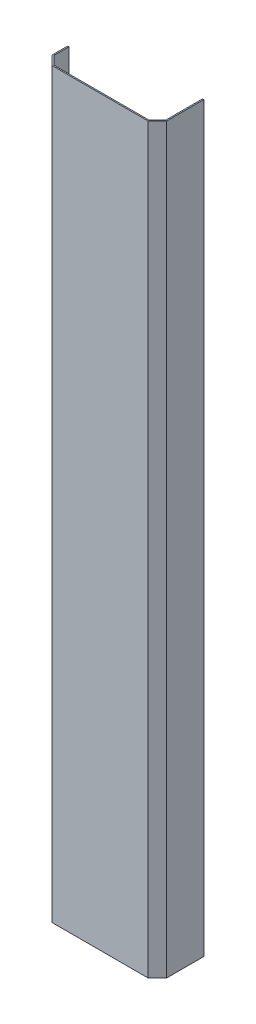
ISO-10303-21;
HEADER;
FILE_DESCRIPTION(('STEP AP214'),'2;1');
FILE_NAME('part.step','',(''),(''),'','','');
FILE_SCHEMA(('AUTOMOTIVE_DESIGN { 1 0 10303 214 1 1 1 1 }'));
ENDSEC;
DATA;
#1=APPLICATION_CONTEXT('core data for automotive mechanical design processes');
#2=APPLICATION_PROTOCOL_DEFINITION('international standard','automotive_design',2000,#1);
#3=PRODUCT_CONTEXT('',#1,'mechanical');
#4=PRODUCT('Part','Part','',(#3));
#5=PRODUCT_RELATED_PRODUCT_CATEGORY('part','',(#4));
#6=PRODUCT_DEFINITION_FORMATION('','',#4);
#7=PRODUCT_DEFINITION_CONTEXT('part definition',#1,'design');
#8=PRODUCT_DEFINITION('design','',#6,#7);
#9=PRODUCT_DEFINITION_SHAPE('','',#8);
#10=(LENGTH_UNIT() NAMED_UNIT(*) SI_UNIT(.MILLI.,.METRE.));
#11=(NAMED_UNIT(*) PLANE_ANGLE_UNIT() SI_UNIT($,.RADIAN.));
#12=(NAMED_UNIT(*) SI_UNIT($,.STERADIAN.) SOLID_ANGLE_UNIT());
#13=UNCERTAINTY_MEASURE_WITH_UNIT(LENGTH_MEASURE(1.E-05),#10,'distance_accuracy_value','');
#14=(GEOMETRIC_REPRESENTATION_CONTEXT(3) GLOBAL_UNCERTAINTY_ASSIGNED_CONTEXT((#13)) GLOBAL_UNIT_ASSIGNED_CONTEXT((#10,
#11,#12)) REPRESENTATION_CONTEXT('',''));
#15=CARTESIAN_POINT('',(0.,0.,0.));
#16=DIRECTION('',(0.,0.,1.));
#17=DIRECTION('',(1.,0.,0.));
#18=AXIS2_PLACEMENT_3D('',#15,#16,#17);
#19=CARTESIAN_POINT('',(83.5857864376268,1200.,83.5857864376269));
#20=DIRECTION('',(-0.707106781186547,0.,-0.707106781186548));
#21=DIRECTION('',(-0.707106781186548,0.,0.707106781186547));
#22=AXIS2_PLACEMENT_3D('',#19,#20,#21);
#23=PLANE('',#22);
#24=DIRECTION('',(0.707106781186548,0.,-0.707106781186547));
#25=VECTOR('',#24,1.);
#26=CARTESIAN_POINT('',(83.5857864376268,0.,83.5857864376269));
#27=LINE('',#26,#25);
#28=CARTESIAN_POINT('',(169.171572875254,0.,-2.));
#29=VERTEX_POINT('',#28);
#30=CARTESIAN_POINT('',(183.,0.,-15.8284271247462));
#31=VERTEX_POINT('',#30);
#32=EDGE_CURVE('E152',#29,#31,#27,.T.);
#33=ORIENTED_EDGE('',*,*,#32,.F.);
#34=DIRECTION('',(0.,-1.,0.));
#35=VECTOR('',#34,1.);
#36=CARTESIAN_POINT('',(169.171572875254,1200.,-2.));
#37=LINE('',#36,#35);
#38=CARTESIAN_POINT('',(169.171572875254,1200.,-2.));
#39=VERTEX_POINT('',#38);
#40=EDGE_CURVE('E11',#39,#29,#37,.T.);
#41=ORIENTED_EDGE('',*,*,#40,.F.);
#42=DIRECTION('',(0.707106781186548,0.,-0.707106781186547));
#43=VECTOR('',#42,1.);
#44=CARTESIAN_POINT('',(83.5857864376268,1200.,83.5857864376269));
#45=LINE('',#44,#43);
#46=CARTESIAN_POINT('',(183.,1200.,-15.8284271247462));
#47=VERTEX_POINT('',#46);
#48=EDGE_CURVE('E181',#39,#47,#45,.T.);
#49=ORIENTED_EDGE('',*,*,#48,.T.);
#50=DIRECTION('',(0.,-1.,0.));
#51=VECTOR('',#50,1.);
#52=CARTESIAN_POINT('',(183.,1200.,-15.8284271247462));
#53=LINE('',#52,#51);
#54=EDGE_CURVE('E51',#47,#31,#53,.T.);
#55=ORIENTED_EDGE('',*,*,#54,.T.);
#56=EDGE_LOOP('',(#33,#41,#49,#55));
#57=FACE_BOUND('',#56,.T.);
#58=ADVANCED_FACE('F35',(#57),#23,.T.);
#59=CARTESIAN_POINT('',(0.,1200.,-2.));
#60=DIRECTION('',(0.,0.,-1.));
#61=DIRECTION('',(-1.,0.,0.));
#62=AXIS2_PLACEMENT_3D('',#59,#60,#61);
#63=PLANE('',#62);
#64=DIRECTION('',(1.,0.,0.));
#65=VECTOR('',#64,1.);
#66=CARTESIAN_POINT('',(0.,0.,-2.));
#67=LINE('',#66,#65);
#68=CARTESIAN_POINT('',(15.8284271247462,0.,-2.));
#69=VERTEX_POINT('',#68);
#70=EDGE_CURVE('E154',#69,#29,#67,.T.);
#71=ORIENTED_EDGE('',*,*,#70,.F.);
#72=DIRECTION('',(0.,-1.,0.));
#73=VECTOR('',#72,1.);
#74=CARTESIAN_POINT('',(15.8284271247462,1200.,-2.));
#75=LINE('',#74,#73);
#76=CARTESIAN_POINT('',(15.8284271247462,1200.,-2.));
#77=VERTEX_POINT('',#76);
#78=EDGE_CURVE('E43',#77,#69,#75,.T.);
#79=ORIENTED_EDGE('',*,*,#78,.F.);
#80=DIRECTION('',(1.,0.,0.));
#81=VECTOR('',#80,1.);
#82=CARTESIAN_POINT('',(0.,1200.,-2.));
#83=LINE('',#82,#81);
#84=EDGE_CURVE('E212',#77,#39,#83,.T.);
#85=ORIENTED_EDGE('',*,*,#84,.T.);
#86=ORIENTED_EDGE('',*,*,#40,.T.);
#87=EDGE_LOOP('',(#71,#79,#85,#86));
#88=FACE_BOUND('',#87,.T.);
#89=ADVANCED_FACE('F211',(#88),#63,.T.);
#90=CARTESIAN_POINT('',(8.9142135623731,1200.,-8.9142135623731));
#91=DIRECTION('',(-0.707106781186548,0.,0.707106781186548));
#92=DIRECTION('',(0.707106781186548,0.,0.707106781186548));
#93=AXIS2_PLACEMENT_3D('',#90,#91,#92);
#94=PLANE('',#93);
#95=DIRECTION('',(-0.707106781186548,0.,-0.707106781186548));
#96=VECTOR('',#95,1.);
#97=CARTESIAN_POINT('',(8.9142135623731,0.,-8.9142135623731));
#98=LINE('',#97,#96);
#99=CARTESIAN_POINT('',(2.,0.,-15.8284271247462));
#100=VERTEX_POINT('',#99);
#101=EDGE_CURVE('E157',#69,#100,#98,.T.);
#102=ORIENTED_EDGE('',*,*,#101,.T.);
#103=DIRECTION('',(0.,-1.,0.));
#104=VECTOR('',#103,1.);
#105=CARTESIAN_POINT('',(2.,1200.,-15.8284271247462));
#106=LINE('',#105,#104);
#107=CARTESIAN_POINT('',(2.,1200.,-15.8284271247462));
#108=VERTEX_POINT('',#107);
#109=EDGE_CURVE('E196',#108,#100,#106,.T.);
#110=ORIENTED_EDGE('',*,*,#109,.F.);
#111=DIRECTION('',(-0.707106781186548,0.,-0.707106781186548));
#112=VECTOR('',#111,1.);
#113=CARTESIAN_POINT('',(8.9142135623731,1200.,-8.9142135623731));
#114=LINE('',#113,#112);
#115=EDGE_CURVE('E203',#77,#108,#114,.T.);
#116=ORIENTED_EDGE('',*,*,#115,.F.);
#117=ORIENTED_EDGE('',*,*,#78,.T.);
#118=EDGE_LOOP('',(#102,#110,#116,#117));
#119=FACE_BOUND('',#118,.T.);
#120=ADVANCED_FACE('F201',(#119),#94,.F.);
#121=CARTESIAN_POINT('',(2.,1200.,0.));
#122=DIRECTION('',(-1.,0.,0.));
#123=DIRECTION('',(0.,0.,1.));
#124=AXIS2_PLACEMENT_3D('',#121,#122,#123);
#125=PLANE('',#124);
#126=DIRECTION('',(0.,0.,-1.));
#127=VECTOR('',#126,1.);
#128=CARTESIAN_POINT('',(2.,0.,0.));
#129=LINE('',#128,#127);
#130=CARTESIAN_POINT('',(2.,0.,-40.));
#131=VERTEX_POINT('',#130);
#132=EDGE_CURVE('E159',#100,#131,#129,.T.);
#133=ORIENTED_EDGE('',*,*,#132,.T.);
#134=DIRECTION('',(0.,-1.,0.));
#135=VECTOR('',#134,1.);
#136=CARTESIAN_POINT('',(2.,1200.,-40.));
#137=LINE('',#136,#135);
#138=CARTESIAN_POINT('',(2.,1200.,-40.));
#139=VERTEX_POINT('',#138);
#140=EDGE_CURVE('E194',#139,#131,#137,.T.);
#141=ORIENTED_EDGE('',*,*,#140,.F.);
#142=DIRECTION('',(0.,0.,-1.));
#143=VECTOR('',#142,1.);
#144=CARTESIAN_POINT('',(2.,1200.,0.));
#145=LINE('',#144,#143);
#146=EDGE_CURVE('E353',#108,#139,#145,.T.);
#147=ORIENTED_EDGE('',*,*,#146,.F.);
#148=ORIENTED_EDGE('',*,*,#109,.T.);
#149=EDGE_LOOP('',(#133,#141,#147,#148));
#150=FACE_BOUND('',#149,.T.);
#151=ADVANCED_FACE('F230',(#150),#125,.F.);
#152=CARTESIAN_POINT('',(0.,1200.,-40.));
#153=DIRECTION('',(0.,0.,-1.));
#154=DIRECTION('',(-1.,0.,0.));
#155=AXIS2_PLACEMENT_3D('',#152,#153,#154);
#156=PLANE('',#155);
#157=DIRECTION('',(1.,0.,0.));
#158=VECTOR('',#157,1.);
#159=CARTESIAN_POINT('',(0.,0.,-40.));
#160=LINE('',#159,#158);
#161=CARTESIAN_POINT('',(0.,0.,-40.));
#162=VERTEX_POINT('',#161);
#163=EDGE_CURVE('E162',#162,#131,#160,.T.);
#164=ORIENTED_EDGE('',*,*,#163,.F.);
#165=DIRECTION('',(0.,-1.,0.));
#166=VECTOR('',#165,1.);
#167=CARTESIAN_POINT('',(0.,1200.,-40.));
#168=LINE('',#167,#166);
#169=CARTESIAN_POINT('',(0.,1200.,-40.));
#170=VERTEX_POINT('',#169);
#171=EDGE_CURVE('E192',#170,#162,#168,.T.);
#172=ORIENTED_EDGE('',*,*,#171,.F.);
#173=DIRECTION('',(1.,0.,0.));
#174=VECTOR('',#173,1.);
#175=CARTESIAN_POINT('',(0.,1200.,-40.));
#176=LINE('',#175,#174);
#177=EDGE_CURVE('E351',#170,#139,#176,.T.);
#178=ORIENTED_EDGE('',*,*,#177,.T.);
#179=ORIENTED_EDGE('',*,*,#140,.T.);
#180=EDGE_LOOP('',(#164,#172,#178,#179));
#181=FACE_BOUND('',#180,.T.);
#182=ADVANCED_FACE('F235',(#181),#156,.T.);
#183=CARTESIAN_POINT('',(0.,1200.,0.));
#184=DIRECTION('',(-1.,0.,0.));
#185=DIRECTION('',(0.,0.,1.));
#186=AXIS2_PLACEMENT_3D('',#183,#184,#185);
#187=PLANE('',#186);
#188=DIRECTION('',(0.,0.,-1.));
#189=VECTOR('',#188,1.);
#190=CARTESIAN_POINT('',(0.,0.,0.));
#191=LINE('',#190,#189);
#192=CARTESIAN_POINT('',(0.,0.,-15.));
#193=VERTEX_POINT('',#192);
#194=EDGE_CURVE('E165',#193,#162,#191,.T.);
#195=ORIENTED_EDGE('',*,*,#194,.F.);
#196=DIRECTION('',(0.,-1.,0.));
#197=VECTOR('',#196,1.);
#198=CARTESIAN_POINT('',(0.,1200.,-15.));
#199=LINE('',#198,#197);
#200=CARTESIAN_POINT('',(0.,1200.,-15.));
#201=VERTEX_POINT('',#200);
#202=EDGE_CURVE('E190',#201,#193,#199,.T.);
#203=ORIENTED_EDGE('',*,*,#202,.F.);
#204=DIRECTION('',(0.,0.,-1.));
#205=VECTOR('',#204,1.);
#206=CARTESIAN_POINT('',(0.,1200.,0.));
#207=LINE('',#206,#205);
#208=EDGE_CURVE('E355',#201,#170,#207,.T.);
#209=ORIENTED_EDGE('',*,*,#208,.T.);
#210=ORIENTED_EDGE('',*,*,#171,.T.);
#211=EDGE_LOOP('',(#195,#203,#209,#210));
#212=FACE_BOUND('',#211,.T.);
#213=ADVANCED_FACE('F239',(#212),#187,.T.);
#214=CARTESIAN_POINT('',(7.5,1200.,-7.5));
#215=DIRECTION('',(-0.707106781186548,0.,0.707106781186548));
#216=DIRECTION('',(0.707106781186548,0.,0.707106781186548));
#217=AXIS2_PLACEMENT_3D('',#214,#215,#216);
#218=PLANE('',#217);
#219=DIRECTION('',(-0.707106781186548,0.,-0.707106781186548));
#220=VECTOR('',#219,1.);
#221=CARTESIAN_POINT('',(7.5,0.,-7.5));
#222=LINE('',#221,#220);
#223=CARTESIAN_POINT('',(15.,0.,0.));
#224=VERTEX_POINT('',#223);
#225=EDGE_CURVE('E168',#224,#193,#222,.T.);
#226=ORIENTED_EDGE('',*,*,#225,.F.);
#227=DIRECTION('',(0.,-1.,0.));
#228=VECTOR('',#227,1.);
#229=CARTESIAN_POINT('',(15.,1200.,0.));
#230=LINE('',#229,#228);
#231=CARTESIAN_POINT('',(15.,1200.,0.));
#232=VERTEX_POINT('',#231);
#233=EDGE_CURVE('E188',#232,#224,#230,.T.);
#234=ORIENTED_EDGE('',*,*,#233,.F.);
#235=DIRECTION('',(-0.707106781186548,0.,-0.707106781186548));
#236=VECTOR('',#235,1.);
#237=CARTESIAN_POINT('',(7.5,1200.,-7.5));
#238=LINE('',#237,#236);
#239=EDGE_CURVE('E344',#232,#201,#238,.T.);
#240=ORIENTED_EDGE('',*,*,#239,.T.);
#241=ORIENTED_EDGE('',*,*,#202,.T.);
#242=EDGE_LOOP('',(#226,#234,#240,#241));
#243=FACE_BOUND('',#242,.T.);
#244=ADVANCED_FACE('F243',(#243),#218,.T.);
#245=CARTESIAN_POINT('',(0.,1200.,0.));
#246=DIRECTION('',(0.,0.,-1.));
#247=DIRECTION('',(-1.,0.,0.));
#248=AXIS2_PLACEMENT_3D('',#245,#246,#247);
#249=PLANE('',#248);
#250=DIRECTION('',(1.,0.,0.));
#251=VECTOR('',#250,1.);
#252=CARTESIAN_POINT('',(0.,0.,0.));
#253=LINE('',#252,#251);
#254=CARTESIAN_POINT('',(170.,0.,0.));
#255=VERTEX_POINT('',#254);
#256=EDGE_CURVE('E171',#224,#255,#253,.T.);
#257=ORIENTED_EDGE('',*,*,#256,.T.);
#258=DIRECTION('',(0.,-1.,0.));
#259=VECTOR('',#258,1.);
#260=CARTESIAN_POINT('',(170.,1200.,0.));
#261=LINE('',#260,#259);
#262=CARTESIAN_POINT('',(170.,1200.,0.));
#263=VERTEX_POINT('',#262);
#264=EDGE_CURVE('E185',#263,#255,#261,.T.);
#265=ORIENTED_EDGE('',*,*,#264,.F.);
#266=DIRECTION('',(1.,0.,0.));
#267=VECTOR('',#266,1.);
#268=CARTESIAN_POINT('',(0.,1200.,0.));
#269=LINE('',#268,#267);
#270=EDGE_CURVE('E362',#232,#263,#269,.T.);
#271=ORIENTED_EDGE('',*,*,#270,.F.);
#272=ORIENTED_EDGE('',*,*,#233,.T.);
#273=EDGE_LOOP('',(#257,#265,#271,#272));
#274=FACE_BOUND('',#273,.T.);
#275=ADVANCED_FACE('F247',(#274),#249,.F.);
#276=CARTESIAN_POINT('',(84.9999999999999,1200.,85.));
#277=DIRECTION('',(-0.707106781186547,0.,-0.707106781186548));
#278=DIRECTION('',(-0.707106781186548,0.,0.707106781186547));
#279=AXIS2_PLACEMENT_3D('',#276,#277,#278);
#280=PLANE('',#279);
#281=DIRECTION('',(0.707106781186548,0.,-0.707106781186547));
#282=VECTOR('',#281,1.);
#283=CARTESIAN_POINT('',(84.9999999999999,0.,85.));
#284=LINE('',#283,#282);
#285=CARTESIAN_POINT('',(185.,0.,-15.));
#286=VERTEX_POINT('',#285);
#287=EDGE_CURVE('E173',#255,#286,#284,.T.);
#288=ORIENTED_EDGE('',*,*,#287,.T.);
#289=DIRECTION('',(0.,-1.,0.));
#290=VECTOR('',#289,1.);
#291=CARTESIAN_POINT('',(185.,1200.,-15.));
#292=LINE('',#291,#290);
#293=CARTESIAN_POINT('',(185.,1200.,-15.));
#294=VERTEX_POINT('',#293);
#295=EDGE_CURVE('E144',#294,#286,#292,.T.);
#296=ORIENTED_EDGE('',*,*,#295,.F.);
#297=DIRECTION('',(0.707106781186548,0.,-0.707106781186547));
#298=VECTOR('',#297,1.);
#299=CARTESIAN_POINT('',(84.9999999999999,1200.,85.));
#300=LINE('',#299,#298);
#301=EDGE_CURVE('E132',#263,#294,#300,.T.);
#302=ORIENTED_EDGE('',*,*,#301,.F.);
#303=ORIENTED_EDGE('',*,*,#264,.T.);
#304=EDGE_LOOP('',(#288,#296,#302,#303));
#305=FACE_BOUND('',#304,.T.);
#306=ADVANCED_FACE('F251',(#305),#280,.F.);
#307=CARTESIAN_POINT('',(185.,1200.,0.));
#308=DIRECTION('',(-1.,0.,0.));
#309=DIRECTION('',(0.,0.,1.));
#310=AXIS2_PLACEMENT_3D('',#307,#308,#309);
#311=PLANE('',#310);
#312=DIRECTION('',(0.,0.,-1.));
#313=VECTOR('',#312,1.);
#314=CARTESIAN_POINT('',(185.,0.,0.));
#315=LINE('',#314,#313);
#316=CARTESIAN_POINT('',(185.,0.,-75.));
#317=VERTEX_POINT('',#316);
#318=EDGE_CURVE('E141',#286,#317,#315,.T.);
#319=ORIENTED_EDGE('',*,*,#318,.T.);
#320=DIRECTION('',(0.,-1.,0.));
#321=VECTOR('',#320,1.);
#322=CARTESIAN_POINT('',(185.,1200.,-75.));
#323=LINE('',#322,#321);
#324=CARTESIAN_POINT('',(185.,1200.,-75.));
#325=VERTEX_POINT('',#324);
#326=EDGE_CURVE('E138',#325,#317,#323,.T.);
#327=ORIENTED_EDGE('',*,*,#326,.F.);
#328=DIRECTION('',(0.,0.,-1.));
#329=VECTOR('',#328,1.);
#330=CARTESIAN_POINT('',(185.,1200.,0.));
#331=LINE('',#330,#329);
#332=EDGE_CURVE('E125',#294,#325,#331,.T.);
#333=ORIENTED_EDGE('',*,*,#332,.F.);
#334=ORIENTED_EDGE('',*,*,#295,.T.);
#335=EDGE_LOOP('',(#319,#327,#333,#334));
#336=FACE_BOUND('',#335,.T.);
#337=ADVANCED_FACE('F139',(#336),#311,.F.);
#338=CARTESIAN_POINT('',(0.,1200.,-75.));
#339=DIRECTION('',(0.,0.,1.));
#340=DIRECTION('',(1.,0.,0.));
#341=AXIS2_PLACEMENT_3D('',#338,#339,#340);
#342=PLANE('',#341);
#343=DIRECTION('',(-1.,0.,0.));
#344=VECTOR('',#343,1.);
#345=CARTESIAN_POINT('',(0.,0.,-75.));
#346=LINE('',#345,#344);
#347=CARTESIAN_POINT('',(183.,0.,-75.));
#348=VERTEX_POINT('',#347);
#349=EDGE_CURVE('E176',#317,#348,#346,.T.);
#350=ORIENTED_EDGE('',*,*,#349,.T.);
#351=DIRECTION('',(0.,-1.,0.));
#352=VECTOR('',#351,1.);
#353=CARTESIAN_POINT('',(183.,1200.,-75.));
#354=LINE('',#353,#352);
#355=CARTESIAN_POINT('',(183.,1200.,-75.));
#356=VERTEX_POINT('',#355);
#357=EDGE_CURVE('E89',#356,#348,#354,.T.);
#358=ORIENTED_EDGE('',*,*,#357,.F.);
#359=DIRECTION('',(-1.,0.,0.));
#360=VECTOR('',#359,1.);
#361=CARTESIAN_POINT('',(0.,1200.,-75.));
#362=LINE('',#361,#360);
#363=EDGE_CURVE('E130',#325,#356,#362,.T.);
#364=ORIENTED_EDGE('',*,*,#363,.F.);
#365=ORIENTED_EDGE('',*,*,#326,.T.);
#366=EDGE_LOOP('',(#350,#358,#364,#365));
#367=FACE_BOUND('',#366,.T.);
#368=ADVANCED_FACE('F146',(#367),#342,.F.);
#369=CARTESIAN_POINT('',(183.,1200.,0.));
#370=DIRECTION('',(-1.,0.,0.));
#371=DIRECTION('',(0.,0.,1.));
#372=AXIS2_PLACEMENT_3D('',#369,#370,#371);
#373=PLANE('',#372);
#374=DIRECTION('',(0.,0.,-1.));
#375=VECTOR('',#374,1.);
#376=CARTESIAN_POINT('',(183.,0.,0.));
#377=LINE('',#376,#375);
#378=EDGE_CURVE('E178',#31,#348,#377,.T.);
#379=ORIENTED_EDGE('',*,*,#378,.F.);
#380=ORIENTED_EDGE('',*,*,#54,.F.);
#381=DIRECTION('',(0.,0.,-1.));
#382=VECTOR('',#381,1.);
#383=CARTESIAN_POINT('',(183.,1200.,0.));
#384=LINE('',#383,#382);
#385=EDGE_CURVE('E147',#47,#356,#384,.T.);
#386=ORIENTED_EDGE('',*,*,#385,.T.);
#387=ORIENTED_EDGE('',*,*,#357,.T.);
#388=EDGE_LOOP('',(#379,#380,#386,#387));
#389=FACE_BOUND('',#388,.T.);
#390=ADVANCED_FACE('F213',(#389),#373,.T.);
#391=CARTESIAN_POINT('',(0.,1200.,0.));
#392=DIRECTION('',(0.,1.,0.));
#393=DIRECTION('',(0.,0.,1.));
#394=AXIS2_PLACEMENT_3D('',#391,#392,#393);
#395=PLANE('',#394);
#396=ORIENTED_EDGE('',*,*,#48,.F.);
#397=ORIENTED_EDGE('',*,*,#84,.F.);
#398=ORIENTED_EDGE('',*,*,#115,.T.);
#399=ORIENTED_EDGE('',*,*,#146,.T.);
#400=ORIENTED_EDGE('',*,*,#177,.F.);
#401=ORIENTED_EDGE('',*,*,#208,.F.);
#402=ORIENTED_EDGE('',*,*,#239,.F.);
#403=ORIENTED_EDGE('',*,*,#270,.T.);
#404=ORIENTED_EDGE('',*,*,#301,.T.);
#405=ORIENTED_EDGE('',*,*,#332,.T.);
#406=ORIENTED_EDGE('',*,*,#363,.T.);
#407=ORIENTED_EDGE('',*,*,#385,.F.);
#408=EDGE_LOOP('',(#396,#397,#398,#399,#400,#401,#402,#403,#404,#405,#406,#407));
#409=FACE_BOUND('',#408,.T.);
#410=ADVANCED_FACE('F127',(#409),#395,.T.);
#411=CARTESIAN_POINT('',(0.,0.,0.));
#412=DIRECTION('',(0.,1.,0.));
#413=DIRECTION('',(0.,0.,1.));
#414=AXIS2_PLACEMENT_3D('',#411,#412,#413);
#415=PLANE('',#414);
#416=ORIENTED_EDGE('',*,*,#32,.T.);
#417=ORIENTED_EDGE('',*,*,#378,.T.);
#418=ORIENTED_EDGE('',*,*,#349,.F.);
#419=ORIENTED_EDGE('',*,*,#318,.F.);
#420=ORIENTED_EDGE('',*,*,#287,.F.);
#421=ORIENTED_EDGE('',*,*,#256,.F.);
#422=ORIENTED_EDGE('',*,*,#225,.T.);
#423=ORIENTED_EDGE('',*,*,#194,.T.);
#424=ORIENTED_EDGE('',*,*,#163,.T.);
#425=ORIENTED_EDGE('',*,*,#132,.F.);
#426=ORIENTED_EDGE('',*,*,#101,.F.);
#427=ORIENTED_EDGE('',*,*,#70,.T.);
#428=EDGE_LOOP('',(#416,#417,#418,#419,#420,#421,#422,#423,#424,#425,#426,#427));
#429=FACE_BOUND('',#428,.T.);
#430=ADVANCED_FACE('F210',(#429),#415,.F.);
#431=CLOSED_SHELL('',(#58,#89,#120,#151,#182,#213,#244,#275,#306,#337,#368,#390,#410,#430));
#432=MANIFOLD_SOLID_BREP('B2',#431);
#433=ADVANCED_BREP_SHAPE_REPRESENTATION('',(#18,#432),#14);
#434=SHAPE_DEFINITION_REPRESENTATION(#9,#433);
ENDSEC;
END-ISO-10303-21;
